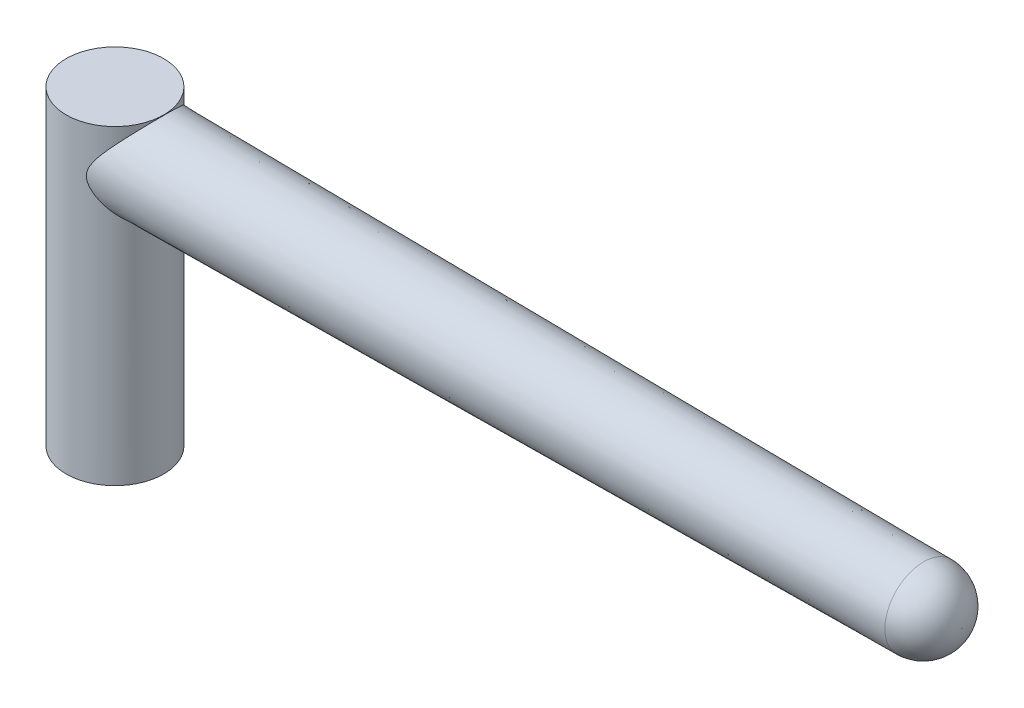
ISO-10303-21;
HEADER;
FILE_DESCRIPTION(('STEP AP214'),'2;1');
FILE_NAME('part.step','',(''),(''),'','','');
FILE_SCHEMA(('AUTOMOTIVE_DESIGN { 1 0 10303 214 1 1 1 1 }'));
ENDSEC;
DATA;
#1=APPLICATION_CONTEXT('core data for automotive mechanical design processes');
#2=APPLICATION_PROTOCOL_DEFINITION('international standard','automotive_design',2000,#1);
#3=PRODUCT_CONTEXT('',#1,'mechanical');
#4=PRODUCT('Part','Part','',(#3));
#5=PRODUCT_RELATED_PRODUCT_CATEGORY('part','',(#4));
#6=PRODUCT_DEFINITION_FORMATION('','',#4);
#7=PRODUCT_DEFINITION_CONTEXT('part definition',#1,'design');
#8=PRODUCT_DEFINITION('design','',#6,#7);
#9=PRODUCT_DEFINITION_SHAPE('','',#8);
#10=(LENGTH_UNIT() NAMED_UNIT(*) SI_UNIT(.MILLI.,.METRE.));
#11=(NAMED_UNIT(*) PLANE_ANGLE_UNIT() SI_UNIT($,.RADIAN.));
#12=(NAMED_UNIT(*) SI_UNIT($,.STERADIAN.) SOLID_ANGLE_UNIT());
#13=UNCERTAINTY_MEASURE_WITH_UNIT(LENGTH_MEASURE(1.E-05),#10,'distance_accuracy_value','');
#14=(GEOMETRIC_REPRESENTATION_CONTEXT(3) GLOBAL_UNCERTAINTY_ASSIGNED_CONTEXT((#13)) GLOBAL_UNIT_ASSIGNED_CONTEXT((#10,
#11,#12)) REPRESENTATION_CONTEXT('',''));
#15=CARTESIAN_POINT('',(0.,0.,0.));
#16=DIRECTION('',(0.,0.,1.));
#17=DIRECTION('',(1.,0.,0.));
#18=AXIS2_PLACEMENT_3D('',#15,#16,#17);
#19=CARTESIAN_POINT('',(0.,31.55,0.));
#20=DIRECTION('',(0.,-1.,0.));
#21=DIRECTION('',(0.,0.,-1.));
#22=AXIS2_PLACEMENT_3D('',#19,#20,#21);
#23=CYLINDRICAL_SURFACE('',#22,4.95);
#24=CARTESIAN_POINT('',(0.,31.55,0.));
#25=DIRECTION('',(0.,1.,0.));
#26=DIRECTION('',(0.,0.,1.));
#27=AXIS2_PLACEMENT_3D('',#24,#25,#26);
#28=CIRCLE('',#27,4.95);
#29=CARTESIAN_POINT('',(0.,31.55,4.95));
#30=VERTEX_POINT('',#29);
#31=EDGE_CURVE('E56',#30,#30,#28,.T.);
#32=ORIENTED_EDGE('',*,*,#31,.F.);
#33=EDGE_LOOP('',(#32));
#34=FACE_BOUND('',#33,.T.);
#35=CARTESIAN_POINT('',(0.,0.,0.));
#36=DIRECTION('',(0.,1.,0.));
#37=DIRECTION('',(0.,0.,1.));
#38=AXIS2_PLACEMENT_3D('',#35,#36,#37);
#39=CIRCLE('',#38,4.95);
#40=CARTESIAN_POINT('',(0.,0.,4.95));
#41=VERTEX_POINT('',#40);
#42=EDGE_CURVE('E59',#41,#41,#39,.T.);
#43=ORIENTED_EDGE('',*,*,#42,.T.);
#44=EDGE_LOOP('',(#43));
#45=FACE_BOUND('',#44,.T.);
#46=CARTESIAN_POINT('',(2.28781793438736,25.4273050165414,-4.38957732579067));
#47=CARTESIAN_POINT('',(2.21650894022856,25.5361198173086,-4.42674227521742));
#48=CARTESIAN_POINT('',(2.14772724216028,25.6478296242196,-4.46035954588733));
#49=CARTESIAN_POINT('',(2.01928691409521,25.8786399118595,-4.51995186240702));
#50=CARTESIAN_POINT('',(1.95963329369808,25.997744400836,-4.54592271898541));
#51=CARTESIAN_POINT('',(1.86778445750881,26.2180882624416,-4.58430195046838));
#52=CARTESIAN_POINT('',(1.83244353701365,26.3176696921617,-4.5984252762713));
#53=CARTESIAN_POINT('',(1.77699901912893,26.5215053165355,-4.62013883353317));
#54=CARTESIAN_POINT('',(1.7568359839934,26.6257395723951,-4.627754565237));
#55=CARTESIAN_POINT('',(1.73590467946259,26.8377711945457,-4.63565536597141));
#56=CARTESIAN_POINT('',(1.7353592689416,26.9455955823065,-4.63585620145367));
#57=CARTESIAN_POINT('',(1.75440775783245,27.1592711360822,-4.62867432969068));
#58=CARTESIAN_POINT('',(1.77404591633172,27.2651174452189,-4.62127495651992));
#59=CARTESIAN_POINT('',(1.83730139383993,27.5031869731301,-4.59654577973382));
#60=CARTESIAN_POINT('',(1.88640038479159,27.633625099164,-4.57687783801081));
#61=CARTESIAN_POINT('',(2.00025384433547,27.8857793653979,-4.52828108159995));
#62=CARTESIAN_POINT('',(2.06507682329749,28.0074542293705,-4.49931155548616));
#63=CARTESIAN_POINT('',(2.20999570150365,28.2550219764161,-4.43006770159249));
#64=CARTESIAN_POINT('',(2.29096616560526,28.3801567522372,-4.38896289451082));
#65=CARTESIAN_POINT('',(2.45803767035512,28.6235751141388,-4.2976338294443));
#66=CARTESIAN_POINT('',(2.54414400430554,28.7418513750099,-4.24740004960907));
#67=CARTESIAN_POINT('',(2.71857228777016,28.9727430176316,-4.13793341319676));
#68=CARTESIAN_POINT('',(2.80689724888428,29.0853500034846,-4.07868770362776));
#69=CARTESIAN_POINT('',(2.98364822453042,29.3051892535161,-3.95123029806244));
#70=CARTESIAN_POINT('',(3.07207418568949,29.4124236131034,-3.88302213576178));
#71=CARTESIAN_POINT('',(3.25829856388539,29.6344015477171,-3.72858569358579));
#72=CARTESIAN_POINT('',(3.35592703116854,29.7484693650162,-3.64117448315925));
#73=CARTESIAN_POINT('',(3.54778952870694,29.9696656996138,-3.45450713855602));
#74=CARTESIAN_POINT('',(3.64202251627872,30.0767920932677,-3.35524740561864));
#75=CARTESIAN_POINT('',(3.82513105991769,30.2829763933854,-3.1448770310993));
#76=CARTESIAN_POINT('',(3.91402097442333,30.3820562008546,-3.03380059807286));
#77=CARTESIAN_POINT('',(4.08492946219868,30.5712432738537,-2.79944823099543));
#78=CARTESIAN_POINT('',(4.16694933336831,30.6613522347799,-2.67617461089971));
#79=CARTESIAN_POINT('',(4.34744721343978,30.8586569200352,-2.37529940168263));
#80=CARTESIAN_POINT('',(4.44265456724087,30.9619373871848,-2.19303143110867));
#81=CARTESIAN_POINT('',(4.57006437578046,31.0995794845686,-1.90475474385813));
#82=CARTESIAN_POINT('',(4.60997652518693,31.1425901089802,-1.80615347975306));
#83=CARTESIAN_POINT('',(4.68403077989546,31.2222536938086,-1.60433449535115));
#84=CARTESIAN_POINT('',(4.71817531778756,31.2589093347226,-1.50111874464089));
#85=CARTESIAN_POINT('',(4.78036431706026,31.3255841552543,-1.28953459390753));
#86=CARTESIAN_POINT('',(4.80834395866856,31.3555328651564,-1.18112480519249));
#87=CARTESIAN_POINT('',(4.85713958971595,31.4077136593642,-0.960936768357306));
#88=CARTESIAN_POINT('',(4.87795944671516,31.4299499098288,-0.849160374407476));
#89=CARTESIAN_POINT('',(4.91194166132246,31.4662233879107,-0.62319702102715));
#90=CARTESIAN_POINT('',(4.92510838022125,31.4802652852589,-0.509011473025791));
#91=CARTESIAN_POINT('',(4.94345758671752,31.4998299274827,-0.279281466228644));
#92=CARTESIAN_POINT('',(4.94864129445238,31.5053539742416,-0.163737217819751));
#93=CARTESIAN_POINT('',(4.95073482506385,31.5075851246818,0.0514535153918337));
#94=CARTESIAN_POINT('',(4.94869295543598,31.5054093397207,0.151081169994964));
#95=CARTESIAN_POINT('',(4.93863209452331,31.4946848864126,0.349721542598301));
#96=CARTESIAN_POINT('',(4.93061124696823,31.4861342388862,0.448734059990909));
#97=CARTESIAN_POINT('',(4.90874898475291,31.4628143603558,0.645336429985007));
#98=CARTESIAN_POINT('',(4.89490968132984,31.448047384955,0.742926785344393));
#99=CARTESIAN_POINT('',(4.86167635822419,31.4125560278116,0.936069601831927));
#100=CARTESIAN_POINT('',(4.84228013240699,31.3918292799883,1.03162123735451));
#101=CARTESIAN_POINT('',(4.77727052454199,31.3222847702775,1.30988350439889));
#102=CARTESIAN_POINT('',(4.72427582661454,31.2655075473896,1.48898358914613));
#103=CARTESIAN_POINT('',(4.60144013806822,31.1334373797211,1.8338197189327));
#104=CARTESIAN_POINT('',(4.53159451010402,31.0581393379333,1.99955206841404));
#105=CARTESIAN_POINT('',(4.34314191142474,30.8539896956094,2.38854749877702));
#106=CARTESIAN_POINT('',(4.21682701377679,30.7163787172559,2.60355891832126));
#107=CARTESIAN_POINT('',(4.01246440525861,30.4911601608814,2.90125268864578));
#108=CARTESIAN_POINT('',(3.94171242696704,30.412785914003,2.99650468959552));
#109=CARTESIAN_POINT('',(3.79619944221964,30.250436670096,3.1788268740449));
#110=CARTESIAN_POINT('',(3.7214394322717,30.1664630639694,3.26589907658767));
#111=CARTESIAN_POINT('',(3.54485213248064,29.9662870022414,3.45810796784697));
#112=CARTESIAN_POINT('',(3.44190804381741,29.8482557955385,3.56031115931118));
#113=CARTESIAN_POINT('',(3.23277826191984,29.6043008747278,3.75122511649139));
#114=CARTESIAN_POINT('',(3.12659067992326,29.4783725151811,3.83992783351558));
#115=CARTESIAN_POINT('',(2.91347992732393,29.2190562638331,4.00402187976647));
#116=CARTESIAN_POINT('',(2.8065578493715,29.0856779494506,4.07942980430591));
#117=CARTESIAN_POINT('',(2.59491693439772,28.8108310136355,4.21720025087995));
#118=CARTESIAN_POINT('',(2.49019625732384,28.6693695488988,4.27957409198802));
#119=CARTESIAN_POINT('',(2.30594126200918,28.4027161891744,4.38111219938588));
#120=CARTESIAN_POINT('',(2.22525504416135,28.279147689461,4.42243253766062));
#121=CARTESIAN_POINT('',(2.0734924232246,28.0234240681959,4.49557006078444));
#122=CARTESIAN_POINT('',(2.00240700283987,27.8912771788833,4.52739619726157));
#123=CARTESIAN_POINT('',(1.89676970163224,27.6560499161001,4.57242609640247));
#124=CARTESIAN_POINT('',(1.85759928051292,27.555632434351,4.58835368954977));
#125=CARTESIAN_POINT('',(1.79386673667717,27.3495892326261,4.6136458669002));
#126=CARTESIAN_POINT('',(1.76925446364398,27.243982766005,4.62303300198252));
#127=CARTESIAN_POINT('',(1.73948943496803,27.0279087642032,4.63432719658284));
#128=CARTESIAN_POINT('',(1.73461775259035,26.9173935161789,4.63612622871277));
#129=CARTESIAN_POINT('',(1.74652225740149,26.6976710439283,4.63164934944115));
#130=CARTESIAN_POINT('',(1.76332636780467,26.5884656901783,4.62536302233914));
#131=CARTESIAN_POINT('',(1.81966010925746,26.3526348054951,4.60351651141505));
#132=CARTESIAN_POINT('',(1.86323715491548,26.2271964024191,4.58627922023376));
#133=CARTESIAN_POINT('',(1.96608750866608,25.9843231460072,4.54313875431822));
#134=CARTESIAN_POINT('',(2.02543292645681,25.8669282600467,4.51719562015944));
#135=CARTESIAN_POINT('',(2.15830734153674,25.6296025489476,4.45533770110933));
#136=CARTESIAN_POINT('',(2.23260934951442,25.510288396693,4.41876791065955));
#137=CARTESIAN_POINT('',(2.38671137302452,25.278077163914,4.33747992318447));
#138=CARTESIAN_POINT('',(2.46651722337362,25.1651871325312,4.29275299327638));
#139=CARTESIAN_POINT('',(2.62880388486888,24.9446633869601,4.19533883257892));
#140=CARTESIAN_POINT('',(2.71128809120439,24.837036815237,4.14264116163889));
#141=CARTESIAN_POINT('',(2.87693436450814,24.6266594945694,4.02937020503473));
#142=CARTESIAN_POINT('',(2.96009614283232,24.5239067848343,3.96880012381608));
#143=CARTESIAN_POINT('',(3.13784012511996,24.3084064373732,3.83026415678702));
#144=CARTESIAN_POINT('',(3.23232656321139,24.1963749801108,3.75104941256317));
#145=CARTESIAN_POINT('',(3.41882472960687,23.9785410720731,3.58190268800724));
#146=CARTESIAN_POINT('',(3.51083577007814,23.8727403431007,3.49196776582579));
#147=CARTESIAN_POINT('',(3.78058043915593,23.5658343396288,3.20595426089547));
#148=CARTESIAN_POINT('',(3.95263273541775,23.3745068544765,2.99321239767824));
#149=CARTESIAN_POINT('',(4.22417248537054,23.0757666711947,2.58854955816415));
#150=CARTESIAN_POINT('',(4.33049604097054,22.9598512234471,2.4074493556802));
#151=CARTESIAN_POINT('',(4.52303618373382,22.7510264864285,2.02255827007092));
#152=CARTESIAN_POINT('',(4.60927622791063,22.6580903500083,1.81879427305436));
#153=CARTESIAN_POINT('',(4.74460288395123,22.5126905855683,1.42406081779512));
#154=CARTESIAN_POINT('',(4.79733870868405,22.4562286101423,1.23582925606702));
#155=CARTESIAN_POINT('',(4.88064146898919,22.3671625475679,0.849044790403938));
#156=CARTESIAN_POINT('',(4.91122178831291,22.3345440568827,0.650498195424315));
#157=CARTESIAN_POINT('',(4.94793780359196,22.2953908157077,0.247818300963499));
#158=CARTESIAN_POINT('',(4.95398365288837,22.2889519363149,0.0436672188725716));
#159=CARTESIAN_POINT('',(4.940868401769,22.3029307822806,-0.362889426300624));
#160=CARTESIAN_POINT('',(4.92170598170555,22.3233499136504,-0.565294897442178));
#161=CARTESIAN_POINT('',(4.86156250202235,22.3875569166374,-0.950550000533948));
#162=CARTESIAN_POINT('',(4.82191000073014,22.4299221942183,-1.13385320452535));
#163=CARTESIAN_POINT('',(4.7242079382313,22.5345934110943,-1.48943334569321));
#164=CARTESIAN_POINT('',(4.66615321174019,22.5969049491146,-1.66170717071648));
#165=CARTESIAN_POINT('',(4.51070289838678,22.7643975870737,-2.05306019480158));
#166=CARTESIAN_POINT('',(4.40667901998435,22.8769273804271,-2.26635735123431));
#167=CARTESIAN_POINT('',(4.17744929090343,23.1269519559738,-2.66545186105747));
#168=CARTESIAN_POINT('',(4.05219157267454,23.264507930948,-2.85117973617212));
#169=CARTESIAN_POINT('',(3.83084805752375,23.5106836846429,-3.13820539142002));
#170=CARTESIAN_POINT('',(3.73865878538307,23.6140082193015,-3.24722252202442));
#171=CARTESIAN_POINT('',(3.54957495631807,23.8283686195388,-3.45290053126346));
#172=CARTESIAN_POINT('',(3.45268033613337,23.9394045888012,-3.54956124371052));
#173=CARTESIAN_POINT('',(3.25602869987991,24.1683859415132,-3.73077000390235));
#174=CARTESIAN_POINT('',(3.15627343054518,24.2863271525481,-3.81532526195034));
#175=CARTESIAN_POINT('',(2.95577795736067,24.5289049900467,-3.97266728156294));
#176=CARTESIAN_POINT('',(2.85503827573219,24.6535382090812,-4.04545995808218));
#177=CARTESIAN_POINT('',(2.67494018855746,24.8843464180221,-4.16611192357789));
#178=CARTESIAN_POINT('',(2.59532650148634,24.9892420309535,-4.21604807769578));
#179=CARTESIAN_POINT('',(2.43883838982343,25.2041526650427,-4.30845682967875));
#180=CARTESIAN_POINT('',(2.36196203620352,25.3141639498028,-4.35093476987195));
#181=CARTESIAN_POINT('',(2.28781793438736,25.4273050165414,-4.38957732579067));
#182=B_SPLINE_CURVE_WITH_KNOTS('',3,(#46,#47,#48,#49,#50,#51,#52,#53,#54,#55,#56,#57,#58,#59,
#60,#61,#62,#63,#64,#65,#66,#67,#68,#69,#70,#71,#72,#73,#74,#75,#76,#77,#78,#79,#80,#81,#82,#83,
#84,#85,#86,#87,#88,#89,#90,#91,#92,#93,#94,#95,#96,#97,#98,#99,#100,#101,#102,#103,#104,#105,
#106,#107,#108,#109,#110,#111,#112,#113,#114,#115,#116,#117,#118,#119,#120,#121,#122,#123,#124,
#125,#126,#127,#128,#129,#130,#131,#132,#133,#134,#135,#136,#137,#138,#139,#140,#141,#142,#143,
#144,#145,#146,#147,#148,#149,#150,#151,#152,#153,#154,#155,#156,#157,#158,#159,#160,#161,#162,
#163,#164,#165,#166,#167,#168,#169,#170,#171,#172,#173,#174,#175,#176,#177,#178,#179,#180,#181),
.UNSPECIFIED.,.T.,.F.,(4,2,2,2,2,2,2,2,2,2,2,2,2,2,2,2,2,2,2,2,2,2,2,2,2,2,2,2,2,2,2,2,2,2,2,2,
2,2,2,2,2,2,2,2,2,2,2,2,2,2,2,2,2,2,2,2,2,2,2,2,2,2,2,2,2,2,2,4),(0.,0.405805038090635,
0.811831994242548,1.13064432218172,1.44820156722637,1.76936517973502,2.09123455438548,
2.51113652185093,2.93290197027303,3.39606284936423,3.85970962411706,4.32402397095748,
4.78815579524567,5.30880722172573,5.82961719037186,6.34895849001223,6.86820145249364,
7.55557965728101,7.89946281555131,8.24320057102503,8.59039619929523,8.93740398434374,
9.28421382583651,9.63097065504425,9.92960987862305,10.2283418582096,10.5269655357835,
10.8257079335924,11.4088123661953,11.9920774514896,12.8414605832486,13.2677831014837,
13.6940001112843,14.2542907563083,14.8149141370116,15.3748326833574,15.9342629451141,
16.3935050576746,16.8523127942857,17.1782726389042,17.5031029678259,17.8325424277287,
18.1624067026418,18.5618821625002,18.9632168636847,19.3982952686068,19.8338422242485,
20.2699646842384,20.705910174375,21.2051792068833,21.7045855664441,22.7002957977163,
23.4174943646055,24.1338510134864,24.7416880176107,25.3491575312332,25.9588496370197,
26.5685736613312,27.142968823043,27.717525353585,28.5011737198997,29.2867646259023,
29.8148420521962,30.3429265801176,30.8706952476415,31.3981976888868,31.82044044825,
32.2423795096074),.UNSPECIFIED.);
#183=CARTESIAN_POINT('',(2.28781793438736,25.4273050165414,-4.38957732579067));
#184=VERTEX_POINT('',#183);
#185=EDGE_CURVE('E58',#184,#184,#182,.T.);
#186=ORIENTED_EDGE('',*,*,#185,.F.);
#187=EDGE_LOOP('',(#186));
#188=FACE_BOUND('',#187,.T.);
#189=ADVANCED_FACE('F39',(#34,#45,#188),#23,.T.);
#190=CARTESIAN_POINT('',(0.,31.55,0.));
#191=DIRECTION('',(0.,1.,0.));
#192=DIRECTION('',(0.,0.,1.));
#193=AXIS2_PLACEMENT_3D('',#190,#191,#192);
#194=PLANE('',#193);
#195=CARTESIAN_POINT('',(0.,31.55,0.));
#196=VERTEX_POINT('',#195);
#197=VERTEX_LOOP('',#196);
#198=FACE_BOUND('',#197,.T.);
#199=ORIENTED_EDGE('',*,*,#31,.T.);
#200=EDGE_LOOP('',(#199));
#201=FACE_BOUND('',#200,.T.);
#202=ADVANCED_FACE('F49',(#198,#201),#194,.T.);
#203=CARTESIAN_POINT('',(0.,0.,0.));
#204=DIRECTION('',(0.,1.,0.));
#205=DIRECTION('',(0.,0.,1.));
#206=AXIS2_PLACEMENT_3D('',#203,#204,#205);
#207=PLANE('',#206);
#208=CARTESIAN_POINT('',(0.,0.,0.));
#209=DIRECTION('',(0.,-1.,0.));
#210=DIRECTION('',(0.,0.,-1.));
#211=AXIS2_PLACEMENT_3D('',#208,#209,#210);
#212=CIRCLE('',#211,3.07);
#213=CARTESIAN_POINT('',(0.,0.,-3.07));
#214=VERTEX_POINT('',#213);
#215=EDGE_CURVE('E107',#214,#214,#212,.T.);
#216=ORIENTED_EDGE('',*,*,#215,.F.);
#217=EDGE_LOOP('',(#216));
#218=FACE_BOUND('',#217,.T.);
#219=ORIENTED_EDGE('',*,*,#42,.F.);
#220=EDGE_LOOP('',(#219));
#221=FACE_BOUND('',#220,.T.);
#222=ADVANCED_FACE('F52',(#218,#221),#207,.F.);
#223=CARTESIAN_POINT('',(0.,26.9,0.));
#224=DIRECTION('',(-1.,0.,0.));
#225=DIRECTION('',(0.,0.,-1.));
#226=AXIS2_PLACEMENT_3D('',#223,#224,#225);
#227=CONICAL_SURFACE('',#226,4.65,0.00872664625997167);
#228=CARTESIAN_POINT('',(82.0340334884437,26.9,0.));
#229=DIRECTION('',(-1.,0.,0.));
#230=DIRECTION('',(0.,0.,1.));
#231=AXIS2_PLACEMENT_3D('',#228,#229,#230);
#232=CIRCLE('',#231,3.93409983540367);
#233=CARTESIAN_POINT('',(82.0340334884437,26.9,3.93409983540367));
#234=VERTEX_POINT('',#233);
#235=EDGE_CURVE('E11',#234,#234,#232,.T.);
#236=ORIENTED_EDGE('',*,*,#235,.T.);
#237=EDGE_LOOP('',(#236));
#238=FACE_BOUND('',#237,.T.);
#239=ORIENTED_EDGE('',*,*,#185,.T.);
#240=EDGE_LOOP('',(#239));
#241=FACE_BOUND('',#240,.T.);
#242=ADVANCED_FACE('F86',(#238,#241),#227,.T.);
#243=CARTESIAN_POINT('',(85.9,26.9,0.));
#244=DIRECTION('',(1.,0.,0.));
#245=DIRECTION('',(0.,0.,-1.));
#246=AXIS2_PLACEMENT_3D('',#243,#244,#245);
#247=PLANE('',#246);
#248=CARTESIAN_POINT('',(85.9,26.9,0.));
#249=DIRECTION('',(1.,0.,0.));
#250=DIRECTION('',(0.,0.,-1.));
#251=AXIS2_PLACEMENT_3D('',#248,#249,#250);
#252=CIRCLE('',#251,0.0342483354534041);
#253=CARTESIAN_POINT('',(85.9,26.9,-0.0342483354534041));
#254=VERTEX_POINT('',#253);
#255=EDGE_CURVE('E46',#254,#254,#252,.T.);
#256=ORIENTED_EDGE('',*,*,#255,.T.);
#257=EDGE_LOOP('',(#256));
#258=FACE_BOUND('',#257,.T.);
#259=ADVANCED_FACE('F74',(#258),#247,.T.);
#260=CARTESIAN_POINT('',(82.,26.9,0.));
#261=DIRECTION('',(1.,0.,0.));
#262=DIRECTION('',(0.,0.,-1.));
#263=AXIS2_PLACEMENT_3D('',#260,#261,#262);
#264=DEGENERATE_TOROIDAL_SURFACE('',#263,0.0342483354534041,3.9,.T.);
#265=ORIENTED_EDGE('',*,*,#235,.F.);
#266=EDGE_LOOP('',(#265));
#267=FACE_BOUND('',#266,.T.);
#268=ORIENTED_EDGE('',*,*,#255,.F.);
#269=EDGE_LOOP('',(#268));
#270=FACE_BOUND('',#269,.T.);
#271=ADVANCED_FACE('F41',(#267,#270),#264,.T.);
#272=CARTESIAN_POINT('',(0.,5.3,0.));
#273=DIRECTION('',(0.,-1.,0.));
#274=DIRECTION('',(0.,0.,-1.));
#275=AXIS2_PLACEMENT_3D('',#272,#273,#274);
#276=CYLINDRICAL_SURFACE('',#275,3.07);
#277=CARTESIAN_POINT('',(0.,5.3,0.));
#278=DIRECTION('',(0.,-1.,0.));
#279=DIRECTION('',(0.,0.,-1.));
#280=AXIS2_PLACEMENT_3D('',#277,#278,#279);
#281=CIRCLE('',#280,3.07);
#282=CARTESIAN_POINT('',(0.,5.3,-3.07));
#283=VERTEX_POINT('',#282);
#284=EDGE_CURVE('E64',#283,#283,#281,.T.);
#285=ORIENTED_EDGE('',*,*,#284,.F.);
#286=EDGE_LOOP('',(#285));
#287=FACE_BOUND('',#286,.T.);
#288=ORIENTED_EDGE('',*,*,#215,.T.);
#289=EDGE_LOOP('',(#288));
#290=FACE_BOUND('',#289,.T.);
#291=ADVANCED_FACE('F77',(#287,#290),#276,.F.);
#292=CARTESIAN_POINT('',(0.,5.3,0.));
#293=DIRECTION('',(0.,-1.,0.));
#294=DIRECTION('',(0.,0.,-1.));
#295=AXIS2_PLACEMENT_3D('',#292,#293,#294);
#296=PLANE('',#295);
#297=ORIENTED_EDGE('',*,*,#284,.T.);
#298=EDGE_LOOP('',(#297));
#299=FACE_BOUND('',#298,.T.);
#300=ADVANCED_FACE('F83',(#299),#296,.T.);
#301=CLOSED_SHELL('',(#189,#202,#222,#242,#259,#271,#291,#300));
#302=MANIFOLD_SOLID_BREP('B2',#301);
#303=ADVANCED_BREP_SHAPE_REPRESENTATION('',(#18,#302),#14);
#304=SHAPE_DEFINITION_REPRESENTATION(#9,#303);
ENDSEC;
END-ISO-10303-21;
